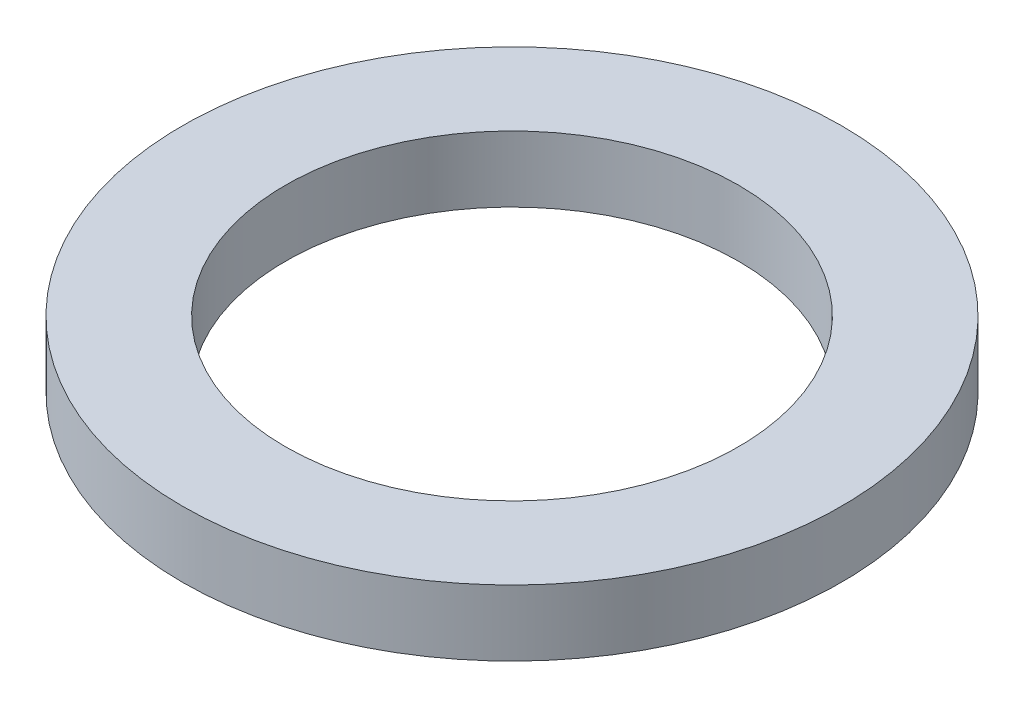
ISO-10303-21;
HEADER;
FILE_DESCRIPTION(('STEP AP214'),'2;1');
FILE_NAME('part.step','',(''),(''),'','','');
FILE_SCHEMA(('AUTOMOTIVE_DESIGN { 1 0 10303 214 1 1 1 1 }'));
ENDSEC;
DATA;
#1=APPLICATION_CONTEXT('core data for automotive mechanical design processes');
#2=APPLICATION_PROTOCOL_DEFINITION('international standard','automotive_design',2000,#1);
#3=PRODUCT_CONTEXT('',#1,'mechanical');
#4=PRODUCT('Part','Part','',(#3));
#5=PRODUCT_RELATED_PRODUCT_CATEGORY('part','',(#4));
#6=PRODUCT_DEFINITION_FORMATION('','',#4);
#7=PRODUCT_DEFINITION_CONTEXT('part definition',#1,'design');
#8=PRODUCT_DEFINITION('design','',#6,#7);
#9=PRODUCT_DEFINITION_SHAPE('','',#8);
#10=(LENGTH_UNIT() NAMED_UNIT(*) SI_UNIT(.MILLI.,.METRE.));
#11=(NAMED_UNIT(*) PLANE_ANGLE_UNIT() SI_UNIT($,.RADIAN.));
#12=(NAMED_UNIT(*) SI_UNIT($,.STERADIAN.) SOLID_ANGLE_UNIT());
#13=UNCERTAINTY_MEASURE_WITH_UNIT(LENGTH_MEASURE(1.E-05),#10,'distance_accuracy_value','');
#14=(GEOMETRIC_REPRESENTATION_CONTEXT(3) GLOBAL_UNCERTAINTY_ASSIGNED_CONTEXT((#13)) GLOBAL_UNIT_ASSIGNED_CONTEXT((#10,
#11,#12)) REPRESENTATION_CONTEXT('',''));
#15=CARTESIAN_POINT('',(0.,0.,0.));
#16=DIRECTION('',(0.,0.,1.));
#17=DIRECTION('',(1.,0.,0.));
#18=AXIS2_PLACEMENT_3D('',#15,#16,#17);
#19=CARTESIAN_POINT('',(0.,8.,0.));
#20=DIRECTION('',(0.,-1.,0.));
#21=DIRECTION('',(0.,0.,-1.));
#22=AXIS2_PLACEMENT_3D('',#19,#20,#21);
#23=CYLINDRICAL_SURFACE('',#22,40.);
#24=CARTESIAN_POINT('',(0.,8.,0.));
#25=DIRECTION('',(0.,1.,0.));
#26=DIRECTION('',(0.,0.,1.));
#27=AXIS2_PLACEMENT_3D('',#24,#25,#26);
#28=CIRCLE('',#27,40.);
#29=CARTESIAN_POINT('',(0.,8.,40.));
#30=VERTEX_POINT('',#29);
#31=EDGE_CURVE('E10',#30,#30,#28,.T.);
#32=ORIENTED_EDGE('',*,*,#31,.F.);
#33=EDGE_LOOP('',(#32));
#34=FACE_BOUND('',#33,.T.);
#35=CARTESIAN_POINT('',(0.,0.,0.));
#36=DIRECTION('',(0.,1.,0.));
#37=DIRECTION('',(0.,0.,1.));
#38=AXIS2_PLACEMENT_3D('',#35,#36,#37);
#39=CIRCLE('',#38,40.);
#40=CARTESIAN_POINT('',(0.,0.,40.));
#41=VERTEX_POINT('',#40);
#42=EDGE_CURVE('E37',#41,#41,#39,.T.);
#43=ORIENTED_EDGE('',*,*,#42,.T.);
#44=EDGE_LOOP('',(#43));
#45=FACE_BOUND('',#44,.T.);
#46=ADVANCED_FACE('F40',(#34,#45),#23,.T.);
#47=CARTESIAN_POINT('',(0.,8.,0.));
#48=DIRECTION('',(0.,1.,0.));
#49=DIRECTION('',(0.,0.,1.));
#50=AXIS2_PLACEMENT_3D('',#47,#48,#49);
#51=PLANE('',#50);
#52=CARTESIAN_POINT('',(0.,8.,0.));
#53=DIRECTION('',(0.,1.,0.));
#54=DIRECTION('',(0.,0.,1.));
#55=AXIS2_PLACEMENT_3D('',#52,#53,#54);
#56=CIRCLE('',#55,27.5);
#57=CARTESIAN_POINT('',(0.,8.,27.5));
#58=VERTEX_POINT('',#57);
#59=EDGE_CURVE('E50',#58,#58,#56,.T.);
#60=ORIENTED_EDGE('',*,*,#59,.F.);
#61=EDGE_LOOP('',(#60));
#62=FACE_BOUND('',#61,.T.);
#63=ORIENTED_EDGE('',*,*,#31,.T.);
#64=EDGE_LOOP('',(#63));
#65=FACE_BOUND('',#64,.T.);
#66=ADVANCED_FACE('F59',(#62,#65),#51,.T.);
#67=CARTESIAN_POINT('',(0.,0.,0.));
#68=DIRECTION('',(0.,1.,0.));
#69=DIRECTION('',(0.,0.,1.));
#70=AXIS2_PLACEMENT_3D('',#67,#68,#69);
#71=PLANE('',#70);
#72=CARTESIAN_POINT('',(0.,0.,0.));
#73=DIRECTION('',(0.,1.,0.));
#74=DIRECTION('',(0.,0.,1.));
#75=AXIS2_PLACEMENT_3D('',#72,#73,#74);
#76=CIRCLE('',#75,27.5);
#77=CARTESIAN_POINT('',(0.,0.,27.5));
#78=VERTEX_POINT('',#77);
#79=EDGE_CURVE('E47',#78,#78,#76,.T.);
#80=ORIENTED_EDGE('',*,*,#79,.T.);
#81=EDGE_LOOP('',(#80));
#82=FACE_BOUND('',#81,.T.);
#83=ORIENTED_EDGE('',*,*,#42,.F.);
#84=EDGE_LOOP('',(#83));
#85=FACE_BOUND('',#84,.T.);
#86=ADVANCED_FACE('F58',(#82,#85),#71,.F.);
#87=CARTESIAN_POINT('',(0.,8.,0.));
#88=DIRECTION('',(0.,-1.,0.));
#89=DIRECTION('',(0.,0.,-1.));
#90=AXIS2_PLACEMENT_3D('',#87,#88,#89);
#91=CYLINDRICAL_SURFACE('',#90,27.5);
#92=ORIENTED_EDGE('',*,*,#59,.T.);
#93=EDGE_LOOP('',(#92));
#94=FACE_BOUND('',#93,.T.);
#95=ORIENTED_EDGE('',*,*,#79,.F.);
#96=EDGE_LOOP('',(#95));
#97=FACE_BOUND('',#96,.T.);
#98=ADVANCED_FACE('F54',(#94,#97),#91,.F.);
#99=CLOSED_SHELL('',(#46,#66,#86,#98));
#100=MANIFOLD_SOLID_BREP('B2',#99);
#101=ADVANCED_BREP_SHAPE_REPRESENTATION('',(#18,#100),#14);
#102=SHAPE_DEFINITION_REPRESENTATION(#9,#101);
ENDSEC;
END-ISO-10303-21;
